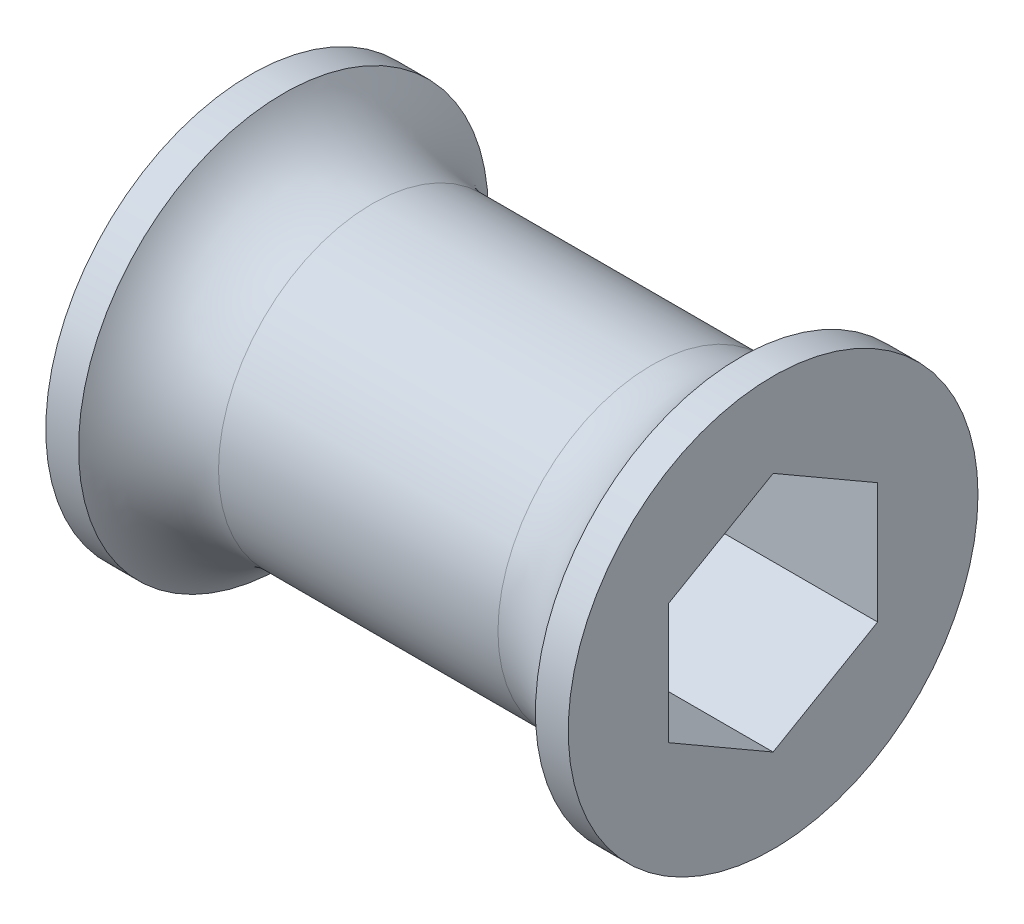
ISO-10303-21;
HEADER;
FILE_DESCRIPTION(('STEP AP214'),'2;1');
FILE_NAME('part.step','',(''),(''),'','','');
FILE_SCHEMA(('AUTOMOTIVE_DESIGN { 1 0 10303 214 1 1 1 1 }'));
ENDSEC;
DATA;
#1=APPLICATION_CONTEXT('core data for automotive mechanical design processes');
#2=APPLICATION_PROTOCOL_DEFINITION('international standard','automotive_design',2000,#1);
#3=PRODUCT_CONTEXT('',#1,'mechanical');
#4=PRODUCT('Part','Part','',(#3));
#5=PRODUCT_RELATED_PRODUCT_CATEGORY('part','',(#4));
#6=PRODUCT_DEFINITION_FORMATION('','',#4);
#7=PRODUCT_DEFINITION_CONTEXT('part definition',#1,'design');
#8=PRODUCT_DEFINITION('design','',#6,#7);
#9=PRODUCT_DEFINITION_SHAPE('','',#8);
#10=(LENGTH_UNIT() NAMED_UNIT(*) SI_UNIT(.MILLI.,.METRE.));
#11=(NAMED_UNIT(*) PLANE_ANGLE_UNIT() SI_UNIT($,.RADIAN.));
#12=(NAMED_UNIT(*) SI_UNIT($,.STERADIAN.) SOLID_ANGLE_UNIT());
#13=UNCERTAINTY_MEASURE_WITH_UNIT(LENGTH_MEASURE(1.E-05),#10,'distance_accuracy_value','');
#14=(GEOMETRIC_REPRESENTATION_CONTEXT(3) GLOBAL_UNCERTAINTY_ASSIGNED_CONTEXT((#13)) GLOBAL_UNIT_ASSIGNED_CONTEXT((#10,
#11,#12)) REPRESENTATION_CONTEXT('',''));
#15=CARTESIAN_POINT('',(0.,0.,0.));
#16=DIRECTION('',(0.,0.,1.));
#17=DIRECTION('',(1.,0.,0.));
#18=AXIS2_PLACEMENT_3D('',#15,#16,#17);
#19=CARTESIAN_POINT('',(32.385,0.,0.));
#20=DIRECTION('',(1.,0.,0.));
#21=DIRECTION('',(0.,0.,-1.));
#22=AXIS2_PLACEMENT_3D('',#19,#20,#21);
#23=PLANE('',#22);
#24=DIRECTION('',(0.,0.5,-0.866025403784439));
#25=VECTOR('',#24,1.);
#26=CARTESIAN_POINT('',(32.385,3.73949769354121,6.477));
#27=LINE('',#26,#25);
#28=CARTESIAN_POINT('',(32.385,3.73949769354121,6.477));
#29=VERTEX_POINT('',#28);
#30=CARTESIAN_POINT('',(32.385,7.47899538708242,0.));
#31=VERTEX_POINT('',#30);
#32=EDGE_CURVE('E87',#29,#31,#27,.T.);
#33=ORIENTED_EDGE('',*,*,#32,.T.);
#34=DIRECTION('',(0.,-0.5,-0.866025403784439));
#35=VECTOR('',#34,1.);
#36=CARTESIAN_POINT('',(32.385,7.47899538708242,0.));
#37=LINE('',#36,#35);
#38=CARTESIAN_POINT('',(32.385,3.73949769354121,-6.477));
#39=VERTEX_POINT('',#38);
#40=EDGE_CURVE('E96',#31,#39,#37,.T.);
#41=ORIENTED_EDGE('',*,*,#40,.T.);
#42=DIRECTION('',(0.,-1.,0.));
#43=VECTOR('',#42,1.);
#44=CARTESIAN_POINT('',(32.385,3.73949769354121,-6.477));
#45=LINE('',#44,#43);
#46=CARTESIAN_POINT('',(32.385,-3.73949769354121,-6.477));
#47=VERTEX_POINT('',#46);
#48=EDGE_CURVE('E47',#39,#47,#45,.T.);
#49=ORIENTED_EDGE('',*,*,#48,.T.);
#50=DIRECTION('',(0.,-0.5,0.866025403784439));
#51=VECTOR('',#50,1.);
#52=CARTESIAN_POINT('',(32.385,-3.73949769354121,-6.477));
#53=LINE('',#52,#51);
#54=CARTESIAN_POINT('',(32.385,-7.47899538708241,0.));
#55=VERTEX_POINT('',#54);
#56=EDGE_CURVE('E110',#47,#55,#53,.T.);
#57=ORIENTED_EDGE('',*,*,#56,.T.);
#58=DIRECTION('',(0.,0.5,0.866025403784439));
#59=VECTOR('',#58,1.);
#60=CARTESIAN_POINT('',(32.385,-7.47899538708241,0.));
#61=LINE('',#60,#59);
#62=CARTESIAN_POINT('',(32.385,-3.73949769354121,6.477));
#63=VERTEX_POINT('',#62);
#64=EDGE_CURVE('E113',#55,#63,#61,.T.);
#65=ORIENTED_EDGE('',*,*,#64,.T.);
#66=DIRECTION('',(0.,1.,0.));
#67=VECTOR('',#66,1.);
#68=CARTESIAN_POINT('',(32.385,-3.73949769354121,6.477));
#69=LINE('',#68,#67);
#70=EDGE_CURVE('E93',#63,#29,#69,.T.);
#71=ORIENTED_EDGE('',*,*,#70,.T.);
#72=EDGE_LOOP('',(#33,#41,#49,#57,#65,#71));
#73=FACE_BOUND('',#72,.T.);
#74=CARTESIAN_POINT('',(32.385,0.,0.));
#75=DIRECTION('',(1.,0.,0.));
#76=DIRECTION('',(0.,0.,-1.));
#77=AXIS2_PLACEMENT_3D('',#74,#75,#76);
#78=CIRCLE('',#77,12.7);
#79=CARTESIAN_POINT('',(32.385,0.,-12.7));
#80=VERTEX_POINT('',#79);
#81=EDGE_CURVE('E11',#80,#80,#78,.T.);
#82=ORIENTED_EDGE('',*,*,#81,.T.);
#83=EDGE_LOOP('',(#82));
#84=FACE_BOUND('',#83,.T.);
#85=ADVANCED_FACE('F33',(#73,#84),#23,.T.);
#86=CARTESIAN_POINT('',(0.,0.,0.));
#87=DIRECTION('',(1.,0.,0.));
#88=DIRECTION('',(0.,0.,-1.));
#89=AXIS2_PLACEMENT_3D('',#86,#87,#88);
#90=CYLINDRICAL_SURFACE('',#89,12.7);
#91=CARTESIAN_POINT('',(30.353,0.,0.));
#92=DIRECTION('',(1.,0.,0.));
#93=DIRECTION('',(0.,0.,-1.));
#94=AXIS2_PLACEMENT_3D('',#91,#92,#93);
#95=CIRCLE('',#94,12.7);
#96=CARTESIAN_POINT('',(30.353,0.,-12.7));
#97=VERTEX_POINT('',#96);
#98=EDGE_CURVE('E40',#97,#97,#95,.T.);
#99=ORIENTED_EDGE('',*,*,#98,.T.);
#100=EDGE_LOOP('',(#99));
#101=FACE_BOUND('',#100,.T.);
#102=ORIENTED_EDGE('',*,*,#81,.F.);
#103=EDGE_LOOP('',(#102));
#104=FACE_BOUND('',#103,.T.);
#105=ADVANCED_FACE('F150',(#101,#104),#90,.T.);
#106=CARTESIAN_POINT('',(24.8537386859688,0.,0.));
#107=DIRECTION('',(1.,0.,0.));
#108=DIRECTION('',(0.,0.,-1.));
#109=AXIS2_PLACEMENT_3D('',#106,#107,#108);
#110=TOROIDAL_SURFACE('',#109,15.875,6.35);
#111=CARTESIAN_POINT('',(24.8537386859688,0.,0.));
#112=DIRECTION('',(1.,0.,0.));
#113=DIRECTION('',(0.,0.,-1.));
#114=AXIS2_PLACEMENT_3D('',#111,#112,#113);
#115=CIRCLE('',#114,9.525);
#116=CARTESIAN_POINT('',(24.8537386859688,0.,-9.525));
#117=VERTEX_POINT('',#116);
#118=EDGE_CURVE('E145',#117,#117,#115,.T.);
#119=ORIENTED_EDGE('',*,*,#118,.T.);
#120=EDGE_LOOP('',(#119));
#121=FACE_BOUND('',#120,.T.);
#122=ORIENTED_EDGE('',*,*,#98,.F.);
#123=EDGE_LOOP('',(#122));
#124=FACE_BOUND('',#123,.T.);
#125=ADVANCED_FACE('F153',(#121,#124),#110,.F.);
#126=CARTESIAN_POINT('',(0.,0.,0.));
#127=DIRECTION('',(1.,0.,0.));
#128=DIRECTION('',(0.,0.,-1.));
#129=AXIS2_PLACEMENT_3D('',#126,#127,#128);
#130=CYLINDRICAL_SURFACE('',#129,9.525);
#131=CARTESIAN_POINT('',(7.53126131403118,0.,0.));
#132=DIRECTION('',(1.,0.,0.));
#133=DIRECTION('',(0.,0.,-1.));
#134=AXIS2_PLACEMENT_3D('',#131,#132,#133);
#135=CIRCLE('',#134,9.525);
#136=CARTESIAN_POINT('',(7.53126131403118,0.,-9.525));
#137=VERTEX_POINT('',#136);
#138=EDGE_CURVE('E142',#137,#137,#135,.T.);
#139=ORIENTED_EDGE('',*,*,#138,.T.);
#140=EDGE_LOOP('',(#139));
#141=FACE_BOUND('',#140,.T.);
#142=ORIENTED_EDGE('',*,*,#118,.F.);
#143=EDGE_LOOP('',(#142));
#144=FACE_BOUND('',#143,.T.);
#145=ADVANCED_FACE('F155',(#141,#144),#130,.T.);
#146=CARTESIAN_POINT('',(7.53126131403118,0.,0.));
#147=DIRECTION('',(1.,0.,0.));
#148=DIRECTION('',(0.,0.,-1.));
#149=AXIS2_PLACEMENT_3D('',#146,#147,#148);
#150=TOROIDAL_SURFACE('',#149,15.875,6.35);
#151=CARTESIAN_POINT('',(2.032,0.,0.));
#152=DIRECTION('',(1.,0.,0.));
#153=DIRECTION('',(0.,0.,-1.));
#154=AXIS2_PLACEMENT_3D('',#151,#152,#153);
#155=CIRCLE('',#154,12.7);
#156=CARTESIAN_POINT('',(2.032,0.,-12.7));
#157=VERTEX_POINT('',#156);
#158=EDGE_CURVE('E139',#157,#157,#155,.T.);
#159=ORIENTED_EDGE('',*,*,#158,.T.);
#160=EDGE_LOOP('',(#159));
#161=FACE_BOUND('',#160,.T.);
#162=ORIENTED_EDGE('',*,*,#138,.F.);
#163=EDGE_LOOP('',(#162));
#164=FACE_BOUND('',#163,.T.);
#165=ADVANCED_FACE('F162',(#161,#164),#150,.F.);
#166=CARTESIAN_POINT('',(0.,0.,0.));
#167=DIRECTION('',(1.,0.,0.));
#168=DIRECTION('',(0.,0.,-1.));
#169=AXIS2_PLACEMENT_3D('',#166,#167,#168);
#170=CYLINDRICAL_SURFACE('',#169,12.7);
#171=CARTESIAN_POINT('',(0.,0.,0.));
#172=DIRECTION('',(1.,0.,0.));
#173=DIRECTION('',(0.,0.,-1.));
#174=AXIS2_PLACEMENT_3D('',#171,#172,#173);
#175=CIRCLE('',#174,12.7);
#176=CARTESIAN_POINT('',(0.,0.,-12.7));
#177=VERTEX_POINT('',#176);
#178=EDGE_CURVE('E129',#177,#177,#175,.T.);
#179=ORIENTED_EDGE('',*,*,#178,.T.);
#180=EDGE_LOOP('',(#179));
#181=FACE_BOUND('',#180,.T.);
#182=ORIENTED_EDGE('',*,*,#158,.F.);
#183=EDGE_LOOP('',(#182));
#184=FACE_BOUND('',#183,.T.);
#185=ADVANCED_FACE('F192',(#181,#184),#170,.T.);
#186=CARTESIAN_POINT('',(0.,0.,0.));
#187=DIRECTION('',(-1.,0.,0.));
#188=DIRECTION('',(0.,0.,1.));
#189=AXIS2_PLACEMENT_3D('',#186,#187,#188);
#190=PLANE('',#189);
#191=DIRECTION('',(0.,0.5,-0.866025403784439));
#192=VECTOR('',#191,1.);
#193=CARTESIAN_POINT('',(0.,3.73949769354121,6.477));
#194=LINE('',#193,#192);
#195=CARTESIAN_POINT('',(0.,3.73949769354121,6.477));
#196=VERTEX_POINT('',#195);
#197=CARTESIAN_POINT('',(0.,7.47899538708242,0.));
#198=VERTEX_POINT('',#197);
#199=EDGE_CURVE('E55',#196,#198,#194,.T.);
#200=ORIENTED_EDGE('',*,*,#199,.F.);
#201=DIRECTION('',(0.,1.,0.));
#202=VECTOR('',#201,1.);
#203=CARTESIAN_POINT('',(0.,-3.73949769354121,6.477));
#204=LINE('',#203,#202);
#205=CARTESIAN_POINT('',(0.,-3.73949769354121,6.477));
#206=VERTEX_POINT('',#205);
#207=EDGE_CURVE('E103',#206,#196,#204,.T.);
#208=ORIENTED_EDGE('',*,*,#207,.F.);
#209=DIRECTION('',(0.,0.5,0.866025403784439));
#210=VECTOR('',#209,1.);
#211=CARTESIAN_POINT('',(0.,-7.47899538708241,0.));
#212=LINE('',#211,#210);
#213=CARTESIAN_POINT('',(0.,-7.47899538708241,0.));
#214=VERTEX_POINT('',#213);
#215=EDGE_CURVE('E106',#214,#206,#212,.T.);
#216=ORIENTED_EDGE('',*,*,#215,.F.);
#217=DIRECTION('',(0.,-0.5,0.866025403784439));
#218=VECTOR('',#217,1.);
#219=CARTESIAN_POINT('',(0.,-3.73949769354121,-6.477));
#220=LINE('',#219,#218);
#221=CARTESIAN_POINT('',(0.,-3.73949769354121,-6.477));
#222=VERTEX_POINT('',#221);
#223=EDGE_CURVE('E122',#222,#214,#220,.T.);
#224=ORIENTED_EDGE('',*,*,#223,.F.);
#225=DIRECTION('',(0.,-1.,0.));
#226=VECTOR('',#225,1.);
#227=CARTESIAN_POINT('',(0.,3.73949769354121,-6.477));
#228=LINE('',#227,#226);
#229=CARTESIAN_POINT('',(0.,3.73949769354121,-6.477));
#230=VERTEX_POINT('',#229);
#231=EDGE_CURVE('E119',#230,#222,#228,.T.);
#232=ORIENTED_EDGE('',*,*,#231,.F.);
#233=DIRECTION('',(0.,-0.5,-0.866025403784439));
#234=VECTOR('',#233,1.);
#235=CARTESIAN_POINT('',(0.,7.47899538708242,0.));
#236=LINE('',#235,#234);
#237=EDGE_CURVE('E117',#198,#230,#236,.T.);
#238=ORIENTED_EDGE('',*,*,#237,.F.);
#239=EDGE_LOOP('',(#200,#208,#216,#224,#232,#238));
#240=FACE_BOUND('',#239,.T.);
#241=ORIENTED_EDGE('',*,*,#178,.F.);
#242=EDGE_LOOP('',(#241));
#243=FACE_BOUND('',#242,.T.);
#244=ADVANCED_FACE('F201',(#240,#243),#190,.T.);
#245=CARTESIAN_POINT('',(32.385,3.73949769354121,6.477));
#246=DIRECTION('',(0.,0.866025403784439,0.5));
#247=DIRECTION('',(0.,-0.5,0.866025403784439));
#248=AXIS2_PLACEMENT_3D('',#245,#246,#247);
#249=PLANE('',#248);
#250=ORIENTED_EDGE('',*,*,#199,.T.);
#251=DIRECTION('',(-1.,0.,0.));
#252=VECTOR('',#251,1.);
#253=CARTESIAN_POINT('',(32.385,7.47899538708242,0.));
#254=LINE('',#253,#252);
#255=EDGE_CURVE('E83',#31,#198,#254,.T.);
#256=ORIENTED_EDGE('',*,*,#255,.F.);
#257=ORIENTED_EDGE('',*,*,#32,.F.);
#258=DIRECTION('',(-1.,0.,0.));
#259=VECTOR('',#258,1.);
#260=CARTESIAN_POINT('',(32.385,3.73949769354121,6.477));
#261=LINE('',#260,#259);
#262=EDGE_CURVE('E127',#29,#196,#261,.T.);
#263=ORIENTED_EDGE('',*,*,#262,.T.);
#264=EDGE_LOOP('',(#250,#256,#257,#263));
#265=FACE_BOUND('',#264,.T.);
#266=ADVANCED_FACE('F85',(#265),#249,.F.);
#267=CARTESIAN_POINT('',(32.385,-3.73949769354121,6.477));
#268=DIRECTION('',(0.,0.,1.));
#269=DIRECTION('',(0.,-1.,0.));
#270=AXIS2_PLACEMENT_3D('',#267,#268,#269);
#271=PLANE('',#270);
#272=ORIENTED_EDGE('',*,*,#207,.T.);
#273=ORIENTED_EDGE('',*,*,#262,.F.);
#274=ORIENTED_EDGE('',*,*,#70,.F.);
#275=DIRECTION('',(-1.,0.,0.));
#276=VECTOR('',#275,1.);
#277=CARTESIAN_POINT('',(32.385,-3.73949769354121,6.477));
#278=LINE('',#277,#276);
#279=EDGE_CURVE('E130',#63,#206,#278,.T.);
#280=ORIENTED_EDGE('',*,*,#279,.T.);
#281=EDGE_LOOP('',(#272,#273,#274,#280));
#282=FACE_BOUND('',#281,.T.);
#283=ADVANCED_FACE('F217',(#282),#271,.F.);
#284=CARTESIAN_POINT('',(32.385,-7.47899538708241,0.));
#285=DIRECTION('',(0.,-0.866025403784439,0.5));
#286=DIRECTION('',(0.,-0.5,-0.866025403784439));
#287=AXIS2_PLACEMENT_3D('',#284,#285,#286);
#288=PLANE('',#287);
#289=ORIENTED_EDGE('',*,*,#215,.T.);
#290=ORIENTED_EDGE('',*,*,#279,.F.);
#291=ORIENTED_EDGE('',*,*,#64,.F.);
#292=DIRECTION('',(-1.,0.,0.));
#293=VECTOR('',#292,1.);
#294=CARTESIAN_POINT('',(32.385,-7.47899538708241,0.));
#295=LINE('',#294,#293);
#296=EDGE_CURVE('E132',#55,#214,#295,.T.);
#297=ORIENTED_EDGE('',*,*,#296,.T.);
#298=EDGE_LOOP('',(#289,#290,#291,#297));
#299=FACE_BOUND('',#298,.T.);
#300=ADVANCED_FACE('F224',(#299),#288,.F.);
#301=CARTESIAN_POINT('',(32.385,-3.73949769354121,-6.477));
#302=DIRECTION('',(0.,-0.866025403784439,-0.5));
#303=DIRECTION('',(0.,0.5,-0.866025403784439));
#304=AXIS2_PLACEMENT_3D('',#301,#302,#303);
#305=PLANE('',#304);
#306=ORIENTED_EDGE('',*,*,#223,.T.);
#307=ORIENTED_EDGE('',*,*,#296,.F.);
#308=ORIENTED_EDGE('',*,*,#56,.F.);
#309=DIRECTION('',(-1.,0.,0.));
#310=VECTOR('',#309,1.);
#311=CARTESIAN_POINT('',(32.385,-3.73949769354121,-6.477));
#312=LINE('',#311,#310);
#313=EDGE_CURVE('E134',#47,#222,#312,.T.);
#314=ORIENTED_EDGE('',*,*,#313,.T.);
#315=EDGE_LOOP('',(#306,#307,#308,#314));
#316=FACE_BOUND('',#315,.T.);
#317=ADVANCED_FACE('F232',(#316),#305,.F.);
#318=CARTESIAN_POINT('',(32.385,3.73949769354121,-6.477));
#319=DIRECTION('',(0.,0.,-1.));
#320=DIRECTION('',(-1.,0.,0.));
#321=AXIS2_PLACEMENT_3D('',#318,#319,#320);
#322=PLANE('',#321);
#323=ORIENTED_EDGE('',*,*,#231,.T.);
#324=ORIENTED_EDGE('',*,*,#313,.F.);
#325=ORIENTED_EDGE('',*,*,#48,.F.);
#326=DIRECTION('',(-1.,0.,0.));
#327=VECTOR('',#326,1.);
#328=CARTESIAN_POINT('',(32.385,3.73949769354121,-6.477));
#329=LINE('',#328,#327);
#330=EDGE_CURVE('E92',#39,#230,#329,.T.);
#331=ORIENTED_EDGE('',*,*,#330,.T.);
#332=EDGE_LOOP('',(#323,#324,#325,#331));
#333=FACE_BOUND('',#332,.T.);
#334=ADVANCED_FACE('F240',(#333),#322,.F.);
#335=CARTESIAN_POINT('',(32.385,7.47899538708242,0.));
#336=DIRECTION('',(0.,0.866025403784439,-0.5));
#337=DIRECTION('',(0.,0.5,0.866025403784439));
#338=AXIS2_PLACEMENT_3D('',#335,#336,#337);
#339=PLANE('',#338);
#340=ORIENTED_EDGE('',*,*,#237,.T.);
#341=ORIENTED_EDGE('',*,*,#330,.F.);
#342=ORIENTED_EDGE('',*,*,#40,.F.);
#343=ORIENTED_EDGE('',*,*,#255,.T.);
#344=EDGE_LOOP('',(#340,#341,#342,#343));
#345=FACE_BOUND('',#344,.T.);
#346=ADVANCED_FACE('F97',(#345),#339,.F.);
#347=CLOSED_SHELL('',(#85,#105,#125,#145,#165,#185,#244,#266,#283,#300,#317,#334,#346));
#348=MANIFOLD_SOLID_BREP('B2',#347);
#349=ADVANCED_BREP_SHAPE_REPRESENTATION('',(#18,#348),#14);
#350=SHAPE_DEFINITION_REPRESENTATION(#9,#349);
ENDSEC;
END-ISO-10303-21;
